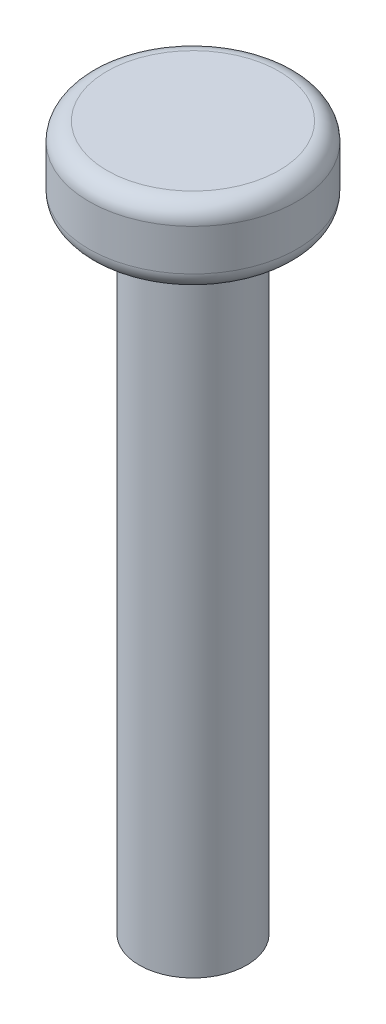
ISO-10303-21;
HEADER;
FILE_DESCRIPTION(('STEP AP214'),'2;1');
FILE_NAME('part.step','',(''),(''),'','','');
FILE_SCHEMA(('AUTOMOTIVE_DESIGN { 1 0 10303 214 1 1 1 1 }'));
ENDSEC;
DATA;
#1=APPLICATION_CONTEXT('core data for automotive mechanical design processes');
#2=APPLICATION_PROTOCOL_DEFINITION('international standard','automotive_design',2000,#1);
#3=PRODUCT_CONTEXT('',#1,'mechanical');
#4=PRODUCT('Part','Part','',(#3));
#5=PRODUCT_RELATED_PRODUCT_CATEGORY('part','',(#4));
#6=PRODUCT_DEFINITION_FORMATION('','',#4);
#7=PRODUCT_DEFINITION_CONTEXT('part definition',#1,'design');
#8=PRODUCT_DEFINITION('design','',#6,#7);
#9=PRODUCT_DEFINITION_SHAPE('','',#8);
#10=(LENGTH_UNIT() NAMED_UNIT(*) SI_UNIT(.MILLI.,.METRE.));
#11=(NAMED_UNIT(*) PLANE_ANGLE_UNIT() SI_UNIT($,.RADIAN.));
#12=(NAMED_UNIT(*) SI_UNIT($,.STERADIAN.) SOLID_ANGLE_UNIT());
#13=UNCERTAINTY_MEASURE_WITH_UNIT(LENGTH_MEASURE(1.E-05),#10,'distance_accuracy_value','');
#14=(GEOMETRIC_REPRESENTATION_CONTEXT(3) GLOBAL_UNCERTAINTY_ASSIGNED_CONTEXT((#13)) GLOBAL_UNIT_ASSIGNED_CONTEXT((#10,
#11,#12)) REPRESENTATION_CONTEXT('',''));
#15=CARTESIAN_POINT('',(0.,0.,0.));
#16=DIRECTION('',(0.,0.,1.));
#17=DIRECTION('',(1.,0.,0.));
#18=AXIS2_PLACEMENT_3D('',#15,#16,#17);
#19=CARTESIAN_POINT('',(0.,35.,0.));
#20=DIRECTION('',(0.,-1.,0.));
#21=DIRECTION('',(0.,0.,-1.));
#22=AXIS2_PLACEMENT_3D('',#19,#20,#21);
#23=CYLINDRICAL_SURFACE('',#22,3.);
#24=CARTESIAN_POINT('',(0.,35.,0.));
#25=DIRECTION('',(0.,1.,0.));
#26=DIRECTION('',(0.,0.,1.));
#27=AXIS2_PLACEMENT_3D('',#24,#25,#26);
#28=CIRCLE('',#27,3.);
#29=CARTESIAN_POINT('',(0.,35.,3.));
#30=VERTEX_POINT('',#29);
#31=EDGE_CURVE('E53',#30,#30,#28,.T.);
#32=ORIENTED_EDGE('',*,*,#31,.F.);
#33=EDGE_LOOP('',(#32));
#34=FACE_BOUND('',#33,.T.);
#35=CARTESIAN_POINT('',(0.,0.,0.));
#36=DIRECTION('',(0.,1.,0.));
#37=DIRECTION('',(0.,0.,1.));
#38=AXIS2_PLACEMENT_3D('',#35,#36,#37);
#39=CIRCLE('',#38,3.);
#40=CARTESIAN_POINT('',(0.,0.,3.));
#41=VERTEX_POINT('',#40);
#42=EDGE_CURVE('E54',#41,#41,#39,.T.);
#43=ORIENTED_EDGE('',*,*,#42,.T.);
#44=EDGE_LOOP('',(#43));
#45=FACE_BOUND('',#44,.T.);
#46=ADVANCED_FACE('F33',(#34,#45),#23,.T.);
#47=CARTESIAN_POINT('',(0.,0.,0.));
#48=DIRECTION('',(0.,1.,0.));
#49=DIRECTION('',(0.,0.,1.));
#50=AXIS2_PLACEMENT_3D('',#47,#48,#49);
#51=PLANE('',#50);
#52=ORIENTED_EDGE('',*,*,#42,.F.);
#53=EDGE_LOOP('',(#52));
#54=FACE_BOUND('',#53,.T.);
#55=ADVANCED_FACE('F64',(#54),#51,.F.);
#56=CARTESIAN_POINT('',(0.,39.3,0.));
#57=DIRECTION('',(0.,-1.,0.));
#58=DIRECTION('',(0.,0.,-1.));
#59=AXIS2_PLACEMENT_3D('',#56,#57,#58);
#60=CYLINDRICAL_SURFACE('',#59,5.8);
#61=CARTESIAN_POINT('',(0.,36.,0.));
#62=DIRECTION('',(0.,1.,0.));
#63=DIRECTION('',(0.,0.,1.));
#64=AXIS2_PLACEMENT_3D('',#61,#62,#63);
#65=CIRCLE('',#64,5.8);
#66=CARTESIAN_POINT('',(0.,36.,5.8));
#67=VERTEX_POINT('',#66);
#68=EDGE_CURVE('E44',#67,#67,#65,.T.);
#69=ORIENTED_EDGE('',*,*,#68,.T.);
#70=EDGE_LOOP('',(#69));
#71=FACE_BOUND('',#70,.T.);
#72=CARTESIAN_POINT('',(0.,38.3,0.));
#73=DIRECTION('',(0.,1.,0.));
#74=DIRECTION('',(0.,0.,1.));
#75=AXIS2_PLACEMENT_3D('',#72,#73,#74);
#76=CIRCLE('',#75,5.8);
#77=CARTESIAN_POINT('',(0.,38.3,5.8));
#78=VERTEX_POINT('',#77);
#79=EDGE_CURVE('E48',#78,#78,#76,.F.);
#80=ORIENTED_EDGE('',*,*,#79,.T.);
#81=EDGE_LOOP('',(#80));
#82=FACE_BOUND('',#81,.T.);
#83=ADVANCED_FACE('F69',(#71,#82),#60,.T.);
#84=CARTESIAN_POINT('',(0.,39.3,0.));
#85=DIRECTION('',(0.,1.,0.));
#86=DIRECTION('',(0.,0.,1.));
#87=AXIS2_PLACEMENT_3D('',#84,#85,#86);
#88=PLANE('',#87);
#89=CARTESIAN_POINT('',(0.,39.3,0.));
#90=DIRECTION('',(0.,1.,0.));
#91=DIRECTION('',(0.,0.,1.));
#92=AXIS2_PLACEMENT_3D('',#89,#90,#91);
#93=CIRCLE('',#92,4.8);
#94=CARTESIAN_POINT('',(0.,39.3,4.8));
#95=VERTEX_POINT('',#94);
#96=EDGE_CURVE('E10',#95,#95,#93,.T.);
#97=ORIENTED_EDGE('',*,*,#96,.T.);
#98=EDGE_LOOP('',(#97));
#99=FACE_BOUND('',#98,.T.);
#100=ADVANCED_FACE('F74',(#99),#88,.T.);
#101=CARTESIAN_POINT('',(0.,35.,0.));
#102=DIRECTION('',(0.,1.,0.));
#103=DIRECTION('',(0.,0.,1.));
#104=AXIS2_PLACEMENT_3D('',#101,#102,#103);
#105=PLANE('',#104);
#106=CARTESIAN_POINT('',(0.,35.,0.));
#107=DIRECTION('',(0.,1.,0.));
#108=DIRECTION('',(0.,0.,1.));
#109=AXIS2_PLACEMENT_3D('',#106,#107,#108);
#110=CIRCLE('',#109,4.8);
#111=CARTESIAN_POINT('',(0.,35.,4.8));
#112=VERTEX_POINT('',#111);
#113=EDGE_CURVE('E40',#112,#112,#110,.F.);
#114=ORIENTED_EDGE('',*,*,#113,.T.);
#115=EDGE_LOOP('',(#114));
#116=FACE_BOUND('',#115,.T.);
#117=ORIENTED_EDGE('',*,*,#31,.T.);
#118=EDGE_LOOP('',(#117));
#119=FACE_BOUND('',#118,.T.);
#120=ADVANCED_FACE('F60',(#116,#119),#105,.F.);
#121=CARTESIAN_POINT('',(0.,36.,0.));
#122=DIRECTION('',(0.,1.,0.));
#123=DIRECTION('',(0.,0.,1.));
#124=AXIS2_PLACEMENT_3D('',#121,#122,#123);
#125=TOROIDAL_SURFACE('',#124,4.8,1.);
#126=ORIENTED_EDGE('',*,*,#113,.F.);
#127=EDGE_LOOP('',(#126));
#128=FACE_BOUND('',#127,.T.);
#129=ORIENTED_EDGE('',*,*,#68,.F.);
#130=EDGE_LOOP('',(#129));
#131=FACE_BOUND('',#130,.T.);
#132=ADVANCED_FACE('F78',(#128,#131),#125,.T.);
#133=CARTESIAN_POINT('',(0.,38.3,0.));
#134=DIRECTION('',(0.,1.,0.));
#135=DIRECTION('',(0.,0.,1.));
#136=AXIS2_PLACEMENT_3D('',#133,#134,#135);
#137=TOROIDAL_SURFACE('',#136,4.8,1.);
#138=ORIENTED_EDGE('',*,*,#79,.F.);
#139=EDGE_LOOP('',(#138));
#140=FACE_BOUND('',#139,.T.);
#141=ORIENTED_EDGE('',*,*,#96,.F.);
#142=EDGE_LOOP('',(#141));
#143=FACE_BOUND('',#142,.T.);
#144=ADVANCED_FACE('F35',(#140,#143),#137,.T.);
#145=CLOSED_SHELL('',(#46,#55,#83,#100,#120,#132,#144));
#146=MANIFOLD_SOLID_BREP('B2',#145);
#147=ADVANCED_BREP_SHAPE_REPRESENTATION('',(#18,#146),#14);
#148=SHAPE_DEFINITION_REPRESENTATION(#9,#147);
ENDSEC;
END-ISO-10303-21;
